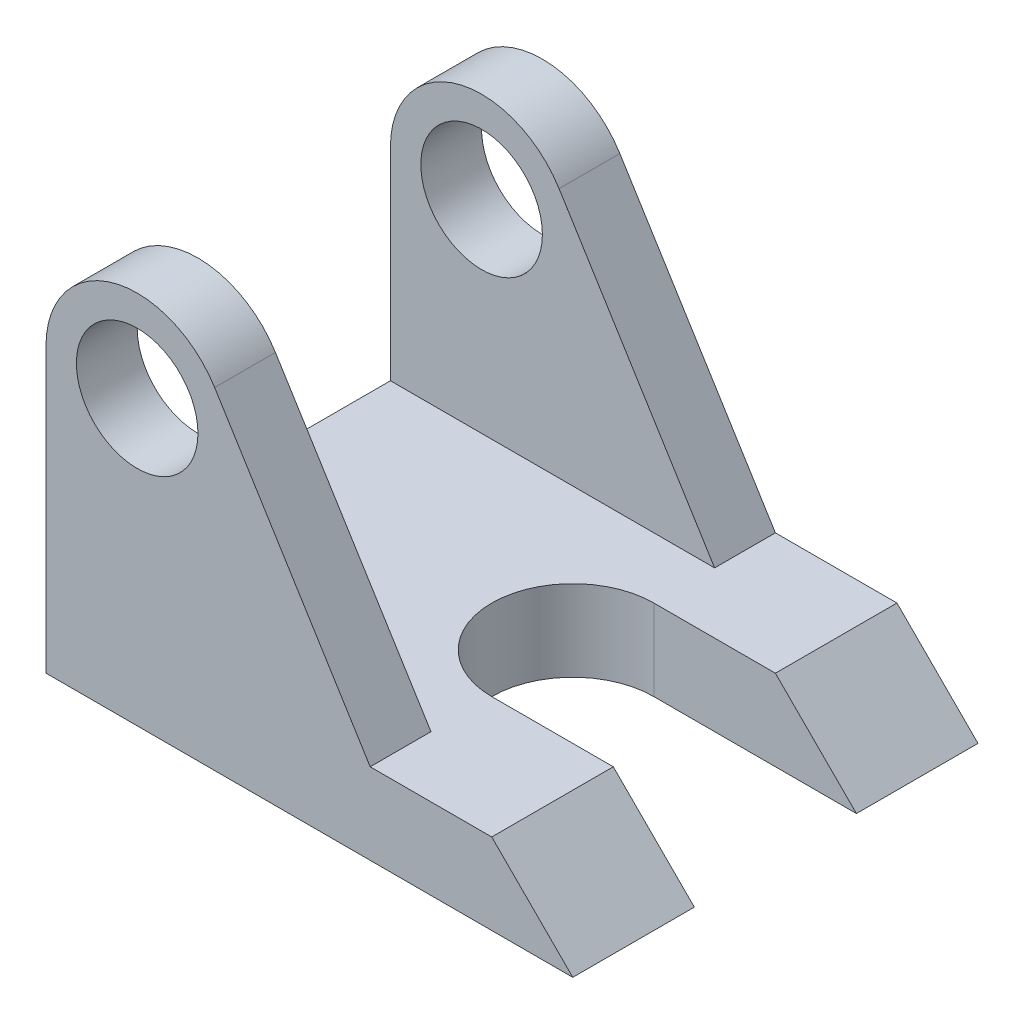
ISO-10303-21;
HEADER;
FILE_DESCRIPTION(('STEP AP214'),'2;1');
FILE_NAME('part.step','',(''),(''),'','','');
FILE_SCHEMA(('AUTOMOTIVE_DESIGN { 1 0 10303 214 1 1 1 1 }'));
ENDSEC;
DATA;
#1=APPLICATION_CONTEXT('core data for automotive mechanical design processes');
#2=APPLICATION_PROTOCOL_DEFINITION('international standard','automotive_design',2000,#1);
#3=PRODUCT_CONTEXT('',#1,'mechanical');
#4=PRODUCT('Part','Part','',(#3));
#5=PRODUCT_RELATED_PRODUCT_CATEGORY('part','',(#4));
#6=PRODUCT_DEFINITION_FORMATION('','',#4);
#7=PRODUCT_DEFINITION_CONTEXT('part definition',#1,'design');
#8=PRODUCT_DEFINITION('design','',#6,#7);
#9=PRODUCT_DEFINITION_SHAPE('','',#8);
#10=(LENGTH_UNIT() NAMED_UNIT(*) SI_UNIT(.MILLI.,.METRE.));
#11=(NAMED_UNIT(*) PLANE_ANGLE_UNIT() SI_UNIT($,.RADIAN.));
#12=(NAMED_UNIT(*) SI_UNIT($,.STERADIAN.) SOLID_ANGLE_UNIT());
#13=UNCERTAINTY_MEASURE_WITH_UNIT(LENGTH_MEASURE(1.E-05),#10,'distance_accuracy_value','');
#14=(GEOMETRIC_REPRESENTATION_CONTEXT(3) GLOBAL_UNCERTAINTY_ASSIGNED_CONTEXT((#13)) GLOBAL_UNIT_ASSIGNED_CONTEXT((#10,
#11,#12)) REPRESENTATION_CONTEXT('',''));
#15=CARTESIAN_POINT('',(0.,0.,0.));
#16=DIRECTION('',(0.,0.,1.));
#17=DIRECTION('',(1.,0.,0.));
#18=AXIS2_PLACEMENT_3D('',#15,#16,#17);
#19=CARTESIAN_POINT('',(65.,65.,-100.));
#20=DIRECTION('',(-0.707106781186547,-0.707106781186548,0.));
#21=DIRECTION('',(0.707106781186548,-0.707106781186547,0.));
#22=AXIS2_PLACEMENT_3D('',#19,#20,#21);
#23=PLANE('',#22);
#24=DIRECTION('',(0.,0.,1.));
#25=VECTOR('',#24,1.);
#26=CARTESIAN_POINT('',(110.,20.,-100.));
#27=LINE('',#26,#25);
#28=CARTESIAN_POINT('',(110.,20.,-100.));
#29=VERTEX_POINT('',#28);
#30=CARTESIAN_POINT('',(110.,20.,-70.));
#31=VERTEX_POINT('',#30);
#32=EDGE_CURVE('E188',#29,#31,#27,.T.);
#33=ORIENTED_EDGE('',*,*,#32,.T.);
#34=DIRECTION('',(0.707106781186548,-0.707106781186547,0.));
#35=VECTOR('',#34,1.);
#36=CARTESIAN_POINT('',(65.,65.,-70.));
#37=LINE('',#36,#35);
#38=CARTESIAN_POINT('',(130.,0.,-70.));
#39=VERTEX_POINT('',#38);
#40=EDGE_CURVE('E132',#31,#39,#37,.T.);
#41=ORIENTED_EDGE('',*,*,#40,.T.);
#42=DIRECTION('',(0.,0.,1.));
#43=VECTOR('',#42,1.);
#44=CARTESIAN_POINT('',(130.,0.,-100.));
#45=LINE('',#44,#43);
#46=CARTESIAN_POINT('',(130.,0.,-100.));
#47=VERTEX_POINT('',#46);
#48=EDGE_CURVE('E129',#47,#39,#45,.T.);
#49=ORIENTED_EDGE('',*,*,#48,.F.);
#50=DIRECTION('',(0.707106781186548,-0.707106781186547,0.));
#51=VECTOR('',#50,1.);
#52=CARTESIAN_POINT('',(65.,65.,-100.));
#53=LINE('',#52,#51);
#54=EDGE_CURVE('E116',#29,#47,#53,.T.);
#55=ORIENTED_EDGE('',*,*,#54,.F.);
#56=EDGE_LOOP('',(#33,#41,#49,#55));
#57=FACE_BOUND('',#56,.T.);
#58=ADVANCED_FACE('F43',(#57),#23,.F.);
#59=CARTESIAN_POINT('',(66.7243801501366,41.3975716511801,-100.));
#60=DIRECTION('',(-0.849740356450421,-0.527201409917985,0.));
#61=DIRECTION('',(0.527201409917985,-0.849740356450421,0.));
#62=AXIS2_PLACEMENT_3D('',#59,#60,#61);
#63=PLANE('',#62);
#64=DIRECTION('',(0.527201409917985,-0.849740356450421,0.));
#65=VECTOR('',#64,1.);
#66=CARTESIAN_POINT('',(66.7243801501366,41.3975716511801,-15.));
#67=LINE('',#66,#65);
#68=CARTESIAN_POINT('',(41.6191580201345,81.8620317231547,-15.));
#69=VERTEX_POINT('',#68);
#70=CARTESIAN_POINT('',(80.,20.,-15.));
#71=VERTEX_POINT('',#70);
#72=EDGE_CURVE('E163',#69,#71,#67,.T.);
#73=ORIENTED_EDGE('',*,*,#72,.F.);
#74=DIRECTION('',(0.,0.,1.));
#75=VECTOR('',#74,1.);
#76=CARTESIAN_POINT('',(41.6191580201345,81.8620317231546,-100.));
#77=LINE('',#76,#75);
#78=CARTESIAN_POINT('',(41.6191580201345,81.8620317231546,0.));
#79=VERTEX_POINT('',#78);
#80=EDGE_CURVE('E157',#69,#79,#77,.T.);
#81=ORIENTED_EDGE('',*,*,#80,.T.);
#82=DIRECTION('',(0.527201409917985,-0.849740356450421,0.));
#83=VECTOR('',#82,1.);
#84=CARTESIAN_POINT('',(66.7243801501366,41.3975716511801,0.));
#85=LINE('',#84,#83);
#86=CARTESIAN_POINT('',(80.,20.,0.));
#87=VERTEX_POINT('',#86);
#88=EDGE_CURVE('E158',#79,#87,#85,.T.);
#89=ORIENTED_EDGE('',*,*,#88,.T.);
#90=DIRECTION('',(0.,0.,1.));
#91=VECTOR('',#90,1.);
#92=CARTESIAN_POINT('',(80.,20.,-100.));
#93=LINE('',#92,#91);
#94=EDGE_CURVE('E95',#71,#87,#93,.T.);
#95=ORIENTED_EDGE('',*,*,#94,.F.);
#96=EDGE_LOOP('',(#73,#81,#89,#95));
#97=FACE_BOUND('',#96,.T.);
#98=ADVANCED_FACE('F45',(#97),#63,.F.);
#99=DIRECTION('',(-0.527201409917985,0.849740356450421,0.));
#100=VECTOR('',#99,1.);
#101=CARTESIAN_POINT('',(66.7243801501366,41.3975716511801,-85.));
#102=LINE('',#101,#100);
#103=CARTESIAN_POINT('',(80.,20.,-85.));
#104=VERTEX_POINT('',#103);
#105=CARTESIAN_POINT('',(41.6191580201345,81.8620317231547,-85.));
#106=VERTEX_POINT('',#105);
#107=EDGE_CURVE('E209',#104,#106,#102,.T.);
#108=ORIENTED_EDGE('',*,*,#107,.F.);
#109=CARTESIAN_POINT('',(80.,20.,-100.));
#110=VERTEX_POINT('',#109);
#111=EDGE_CURVE('E52',#110,#104,#93,.T.);
#112=ORIENTED_EDGE('',*,*,#111,.F.);
#113=DIRECTION('',(0.527201409917985,-0.849740356450421,0.));
#114=VECTOR('',#113,1.);
#115=CARTESIAN_POINT('',(66.7243801501366,41.3975716511801,-100.));
#116=LINE('',#115,#114);
#117=CARTESIAN_POINT('',(41.6191580201345,81.8620317231546,-100.));
#118=VERTEX_POINT('',#117);
#119=EDGE_CURVE('E185',#118,#110,#116,.T.);
#120=ORIENTED_EDGE('',*,*,#119,.F.);
#121=EDGE_CURVE('E104',#118,#106,#77,.T.);
#122=ORIENTED_EDGE('',*,*,#121,.T.);
#123=EDGE_LOOP('',(#108,#112,#120,#122));
#124=FACE_BOUND('',#123,.T.);
#125=ADVANCED_FACE('F318',(#124),#63,.F.);
#126=CARTESIAN_POINT('',(0.,0.,-100.));
#127=DIRECTION('',(1.,0.,0.));
#128=DIRECTION('',(0.,0.,-1.));
#129=AXIS2_PLACEMENT_3D('',#126,#127,#128);
#130=PLANE('',#129);
#131=DIRECTION('',(0.,1.,0.));
#132=VECTOR('',#131,1.);
#133=CARTESIAN_POINT('',(0.,0.,-15.));
#134=LINE('',#133,#132);
#135=CARTESIAN_POINT('',(0.,20.,-15.));
#136=VERTEX_POINT('',#135);
#137=CARTESIAN_POINT('',(0.,70.,-15.));
#138=VERTEX_POINT('',#137);
#139=EDGE_CURVE('E215',#136,#138,#134,.T.);
#140=ORIENTED_EDGE('',*,*,#139,.F.);
#141=DIRECTION('',(0.,0.,1.));
#142=VECTOR('',#141,1.);
#143=CARTESIAN_POINT('',(0.,20.,-100.));
#144=LINE('',#143,#142);
#145=CARTESIAN_POINT('',(0.,20.,-85.));
#146=VERTEX_POINT('',#145);
#147=EDGE_CURVE('E11',#146,#136,#144,.T.);
#148=ORIENTED_EDGE('',*,*,#147,.F.);
#149=DIRECTION('',(0.,-1.,0.));
#150=VECTOR('',#149,1.);
#151=CARTESIAN_POINT('',(0.,0.,-85.));
#152=LINE('',#151,#150);
#153=CARTESIAN_POINT('',(0.,70.,-85.));
#154=VERTEX_POINT('',#153);
#155=EDGE_CURVE('E218',#154,#146,#152,.T.);
#156=ORIENTED_EDGE('',*,*,#155,.F.);
#157=DIRECTION('',(0.,0.,1.));
#158=VECTOR('',#157,1.);
#159=CARTESIAN_POINT('',(0.,70.,-100.));
#160=LINE('',#159,#158);
#161=CARTESIAN_POINT('',(0.,70.,-100.));
#162=VERTEX_POINT('',#161);
#163=EDGE_CURVE('E193',#162,#154,#160,.T.);
#164=ORIENTED_EDGE('',*,*,#163,.F.);
#165=DIRECTION('',(0.,1.,0.));
#166=VECTOR('',#165,1.);
#167=CARTESIAN_POINT('',(0.,0.,-100.));
#168=LINE('',#167,#166);
#169=CARTESIAN_POINT('',(0.,0.,-100.));
#170=VERTEX_POINT('',#169);
#171=EDGE_CURVE('E144',#170,#162,#168,.T.);
#172=ORIENTED_EDGE('',*,*,#171,.F.);
#173=DIRECTION('',(0.,0.,1.));
#174=VECTOR('',#173,1.);
#175=CARTESIAN_POINT('',(0.,0.,-100.));
#176=LINE('',#175,#174);
#177=CARTESIAN_POINT('',(0.,0.,0.));
#178=VERTEX_POINT('',#177);
#179=EDGE_CURVE('E141',#170,#178,#176,.T.);
#180=ORIENTED_EDGE('',*,*,#179,.T.);
#181=DIRECTION('',(0.,1.,0.));
#182=VECTOR('',#181,1.);
#183=CARTESIAN_POINT('',(0.,0.,0.));
#184=LINE('',#183,#182);
#185=CARTESIAN_POINT('',(0.,70.,0.));
#186=VERTEX_POINT('',#185);
#187=EDGE_CURVE('E167',#178,#186,#184,.T.);
#188=ORIENTED_EDGE('',*,*,#187,.T.);
#189=EDGE_CURVE('E197',#138,#186,#160,.T.);
#190=ORIENTED_EDGE('',*,*,#189,.F.);
#191=EDGE_LOOP('',(#140,#148,#156,#164,#172,#180,#188,#190));
#192=FACE_BOUND('',#191,.T.);
#193=ADVANCED_FACE('F246',(#192),#130,.F.);
#194=CARTESIAN_POINT('',(22.5,70.,-100.));
#195=DIRECTION('',(0.,0.,1.));
#196=DIRECTION('',(1.,0.,0.));
#197=AXIS2_PLACEMENT_3D('',#194,#195,#196);
#198=CYLINDRICAL_SURFACE('',#197,22.5);
#199=CARTESIAN_POINT('',(22.5,70.,-15.));
#200=DIRECTION('',(0.,0.,-1.));
#201=DIRECTION('',(-1.,0.,0.));
#202=AXIS2_PLACEMENT_3D('',#199,#200,#201);
#203=CIRCLE('',#202,22.5);
#204=EDGE_CURVE('E208',#69,#138,#203,.F.);
#205=ORIENTED_EDGE('',*,*,#204,.T.);
#206=ORIENTED_EDGE('',*,*,#189,.T.);
#207=CARTESIAN_POINT('',(22.5,70.,0.));
#208=DIRECTION('',(0.,0.,1.));
#209=DIRECTION('',(1.,0.,0.));
#210=AXIS2_PLACEMENT_3D('',#207,#208,#209);
#211=CIRCLE('',#210,22.5);
#212=EDGE_CURVE('E162',#79,#186,#211,.T.);
#213=ORIENTED_EDGE('',*,*,#212,.F.);
#214=ORIENTED_EDGE('',*,*,#80,.F.);
#215=EDGE_LOOP('',(#205,#206,#213,#214));
#216=FACE_BOUND('',#215,.T.);
#217=ADVANCED_FACE('F275',(#216),#198,.T.);
#218=CARTESIAN_POINT('',(22.5,70.,-85.));
#219=DIRECTION('',(0.,0.,1.));
#220=DIRECTION('',(1.,0.,0.));
#221=AXIS2_PLACEMENT_3D('',#218,#219,#220);
#222=CIRCLE('',#221,22.5);
#223=EDGE_CURVE('E203',#154,#106,#222,.F.);
#224=ORIENTED_EDGE('',*,*,#223,.T.);
#225=ORIENTED_EDGE('',*,*,#121,.F.);
#226=CARTESIAN_POINT('',(22.5,70.,-100.));
#227=DIRECTION('',(0.,0.,1.));
#228=DIRECTION('',(1.,0.,0.));
#229=AXIS2_PLACEMENT_3D('',#226,#227,#228);
#230=CIRCLE('',#229,22.5);
#231=EDGE_CURVE('E147',#118,#162,#230,.T.);
#232=ORIENTED_EDGE('',*,*,#231,.T.);
#233=ORIENTED_EDGE('',*,*,#163,.T.);
#234=EDGE_LOOP('',(#224,#225,#232,#233));
#235=FACE_BOUND('',#234,.T.);
#236=ADVANCED_FACE('F239',(#235),#198,.T.);
#237=CARTESIAN_POINT('',(22.5,70.,-100.));
#238=DIRECTION('',(0.,0.,1.));
#239=DIRECTION('',(1.,0.,0.));
#240=AXIS2_PLACEMENT_3D('',#237,#238,#239);
#241=CYLINDRICAL_SURFACE('',#240,15.);
#242=CARTESIAN_POINT('',(22.5,70.,0.));
#243=DIRECTION('',(0.,0.,1.));
#244=DIRECTION('',(1.,0.,0.));
#245=AXIS2_PLACEMENT_3D('',#242,#243,#244);
#246=CIRCLE('',#245,15.);
#247=CARTESIAN_POINT('',(37.5,70.,0.));
#248=VERTEX_POINT('',#247);
#249=EDGE_CURVE('E181',#248,#248,#246,.T.);
#250=ORIENTED_EDGE('',*,*,#249,.T.);
#251=EDGE_LOOP('',(#250));
#252=FACE_BOUND('',#251,.T.);
#253=CARTESIAN_POINT('',(22.5,70.,-15.));
#254=DIRECTION('',(0.,0.,-1.));
#255=DIRECTION('',(-1.,0.,0.));
#256=AXIS2_PLACEMENT_3D('',#253,#254,#255);
#257=CIRCLE('',#256,15.);
#258=CARTESIAN_POINT('',(7.5,70.,-15.));
#259=VERTEX_POINT('',#258);
#260=EDGE_CURVE('E205',#259,#259,#257,.F.);
#261=ORIENTED_EDGE('',*,*,#260,.F.);
#262=EDGE_LOOP('',(#261));
#263=FACE_BOUND('',#262,.T.);
#264=ADVANCED_FACE('F393',(#252,#263),#241,.F.);
#265=CARTESIAN_POINT('',(22.5,70.,-100.));
#266=DIRECTION('',(0.,0.,1.));
#267=DIRECTION('',(1.,0.,0.));
#268=AXIS2_PLACEMENT_3D('',#265,#266,#267);
#269=CIRCLE('',#268,15.);
#270=CARTESIAN_POINT('',(37.5,70.,-100.));
#271=VERTEX_POINT('',#270);
#272=EDGE_CURVE('E153',#271,#271,#269,.T.);
#273=ORIENTED_EDGE('',*,*,#272,.F.);
#274=EDGE_LOOP('',(#273));
#275=FACE_BOUND('',#274,.T.);
#276=CARTESIAN_POINT('',(22.5,70.,-85.));
#277=DIRECTION('',(0.,0.,1.));
#278=DIRECTION('',(1.,0.,0.));
#279=AXIS2_PLACEMENT_3D('',#276,#277,#278);
#280=CIRCLE('',#279,15.);
#281=CARTESIAN_POINT('',(37.5,70.,-85.));
#282=VERTEX_POINT('',#281);
#283=EDGE_CURVE('E200',#282,#282,#280,.F.);
#284=ORIENTED_EDGE('',*,*,#283,.F.);
#285=EDGE_LOOP('',(#284));
#286=FACE_BOUND('',#285,.T.);
#287=ADVANCED_FACE('F312',(#275,#286),#241,.F.);
#288=CARTESIAN_POINT('',(0.,20.,-100.));
#289=DIRECTION('',(0.,-1.,0.));
#290=DIRECTION('',(1.,0.,0.));
#291=AXIS2_PLACEMENT_3D('',#288,#289,#290);
#292=PLANE('',#291);
#293=CARTESIAN_POINT('',(80.,20.,-50.));
#294=DIRECTION('',(0.,1.,0.));
#295=DIRECTION('',(-1.,0.,0.));
#296=AXIS2_PLACEMENT_3D('',#293,#294,#295);
#297=CIRCLE('',#296,20.);
#298=CARTESIAN_POINT('',(80.,20.,-70.));
#299=VERTEX_POINT('',#298);
#300=CARTESIAN_POINT('',(80.,20.,-30.));
#301=VERTEX_POINT('',#300);
#302=EDGE_CURVE('E348',#299,#301,#297,.T.);
#303=ORIENTED_EDGE('',*,*,#302,.F.);
#304=DIRECTION('',(-1.,0.,0.));
#305=VECTOR('',#304,1.);
#306=CARTESIAN_POINT('',(80.,20.,-70.));
#307=LINE('',#306,#305);
#308=EDGE_CURVE('E357',#31,#299,#307,.T.);
#309=ORIENTED_EDGE('',*,*,#308,.F.);
#310=ORIENTED_EDGE('',*,*,#32,.F.);
#311=DIRECTION('',(1.,0.,0.));
#312=VECTOR('',#311,1.);
#313=CARTESIAN_POINT('',(0.,20.,-100.));
#314=LINE('',#313,#312);
#315=EDGE_CURVE('E68',#110,#29,#314,.T.);
#316=ORIENTED_EDGE('',*,*,#315,.F.);
#317=ORIENTED_EDGE('',*,*,#111,.T.);
#318=DIRECTION('',(-1.,0.,0.));
#319=VECTOR('',#318,1.);
#320=CARTESIAN_POINT('',(-19.097686060403,20.,-85.));
#321=LINE('',#320,#319);
#322=EDGE_CURVE('E204',#104,#146,#321,.T.);
#323=ORIENTED_EDGE('',*,*,#322,.T.);
#324=ORIENTED_EDGE('',*,*,#147,.T.);
#325=DIRECTION('',(1.,0.,0.));
#326=VECTOR('',#325,1.);
#327=CARTESIAN_POINT('',(-19.097686060403,20.,-15.));
#328=LINE('',#327,#326);
#329=EDGE_CURVE('E259',#136,#71,#328,.T.);
#330=ORIENTED_EDGE('',*,*,#329,.T.);
#331=ORIENTED_EDGE('',*,*,#94,.T.);
#332=DIRECTION('',(1.,0.,0.));
#333=VECTOR('',#332,1.);
#334=CARTESIAN_POINT('',(0.,20.,0.));
#335=LINE('',#334,#333);
#336=CARTESIAN_POINT('',(110.,20.,0.));
#337=VERTEX_POINT('',#336);
#338=EDGE_CURVE('E178',#87,#337,#335,.T.);
#339=ORIENTED_EDGE('',*,*,#338,.T.);
#340=CARTESIAN_POINT('',(110.,20.,-30.));
#341=VERTEX_POINT('',#340);
#342=EDGE_CURVE('E136',#341,#337,#27,.T.);
#343=ORIENTED_EDGE('',*,*,#342,.F.);
#344=DIRECTION('',(1.,0.,0.));
#345=VECTOR('',#344,1.);
#346=CARTESIAN_POINT('',(130.,20.,-30.));
#347=LINE('',#346,#345);
#348=EDGE_CURVE('E293',#301,#341,#347,.T.);
#349=ORIENTED_EDGE('',*,*,#348,.F.);
#350=EDGE_LOOP('',(#303,#309,#310,#316,#317,#323,#324,#330,#331,#339,#343,#349));
#351=FACE_BOUND('',#350,.T.);
#352=ADVANCED_FACE('F255',(#351),#292,.F.);
#353=CARTESIAN_POINT('',(130.,0.,-30.));
#354=VERTEX_POINT('',#353);
#355=CARTESIAN_POINT('',(130.,0.,0.));
#356=VERTEX_POINT('',#355);
#357=EDGE_CURVE('E137',#354,#356,#45,.T.);
#358=ORIENTED_EDGE('',*,*,#357,.F.);
#359=DIRECTION('',(-0.707106781186548,0.707106781186547,0.));
#360=VECTOR('',#359,1.);
#361=CARTESIAN_POINT('',(65.,65.,-30.));
#362=LINE('',#361,#360);
#363=EDGE_CURVE('E59',#354,#341,#362,.T.);
#364=ORIENTED_EDGE('',*,*,#363,.T.);
#365=ORIENTED_EDGE('',*,*,#342,.T.);
#366=DIRECTION('',(0.707106781186548,-0.707106781186547,0.));
#367=VECTOR('',#366,1.);
#368=CARTESIAN_POINT('',(65.,65.,0.));
#369=LINE('',#368,#367);
#370=EDGE_CURVE('E174',#337,#356,#369,.T.);
#371=ORIENTED_EDGE('',*,*,#370,.T.);
#372=EDGE_LOOP('',(#358,#364,#365,#371));
#373=FACE_BOUND('',#372,.T.);
#374=ADVANCED_FACE('F304',(#373),#23,.F.);
#375=CARTESIAN_POINT('',(0.,0.,-100.));
#376=DIRECTION('',(0.,1.,0.));
#377=DIRECTION('',(-1.,0.,0.));
#378=AXIS2_PLACEMENT_3D('',#375,#376,#377);
#379=PLANE('',#378);
#380=ORIENTED_EDGE('',*,*,#48,.T.);
#381=DIRECTION('',(-1.,0.,0.));
#382=VECTOR('',#381,1.);
#383=CARTESIAN_POINT('',(80.,0.,-70.));
#384=LINE('',#383,#382);
#385=CARTESIAN_POINT('',(80.,0.,-70.));
#386=VERTEX_POINT('',#385);
#387=EDGE_CURVE('E351',#39,#386,#384,.T.);
#388=ORIENTED_EDGE('',*,*,#387,.T.);
#389=CARTESIAN_POINT('',(80.,0.,-50.));
#390=DIRECTION('',(0.,1.,0.));
#391=DIRECTION('',(-1.,0.,0.));
#392=AXIS2_PLACEMENT_3D('',#389,#390,#391);
#393=CIRCLE('',#392,20.);
#394=CARTESIAN_POINT('',(80.,0.,-30.));
#395=VERTEX_POINT('',#394);
#396=EDGE_CURVE('E347',#386,#395,#393,.T.);
#397=ORIENTED_EDGE('',*,*,#396,.T.);
#398=DIRECTION('',(1.,0.,0.));
#399=VECTOR('',#398,1.);
#400=CARTESIAN_POINT('',(130.,0.,-30.));
#401=LINE('',#400,#399);
#402=EDGE_CURVE('E303',#395,#354,#401,.T.);
#403=ORIENTED_EDGE('',*,*,#402,.T.);
#404=ORIENTED_EDGE('',*,*,#357,.T.);
#405=DIRECTION('',(-1.,0.,0.));
#406=VECTOR('',#405,1.);
#407=CARTESIAN_POINT('',(0.,0.,0.));
#408=LINE('',#407,#406);
#409=EDGE_CURVE('E171',#356,#178,#408,.T.);
#410=ORIENTED_EDGE('',*,*,#409,.T.);
#411=ORIENTED_EDGE('',*,*,#179,.F.);
#412=DIRECTION('',(-1.,0.,0.));
#413=VECTOR('',#412,1.);
#414=CARTESIAN_POINT('',(0.,0.,-100.));
#415=LINE('',#414,#413);
#416=EDGE_CURVE('E121',#47,#170,#415,.T.);
#417=ORIENTED_EDGE('',*,*,#416,.F.);
#418=EDGE_LOOP('',(#380,#388,#397,#403,#404,#410,#411,#417));
#419=FACE_BOUND('',#418,.T.);
#420=ADVANCED_FACE('F139',(#419),#379,.F.);
#421=CARTESIAN_POINT('',(0.,0.,-100.));
#422=DIRECTION('',(0.,0.,1.));
#423=DIRECTION('',(1.,0.,0.));
#424=AXIS2_PLACEMENT_3D('',#421,#422,#423);
#425=PLANE('',#424);
#426=ORIENTED_EDGE('',*,*,#119,.T.);
#427=ORIENTED_EDGE('',*,*,#315,.T.);
#428=ORIENTED_EDGE('',*,*,#54,.T.);
#429=ORIENTED_EDGE('',*,*,#416,.T.);
#430=ORIENTED_EDGE('',*,*,#171,.T.);
#431=ORIENTED_EDGE('',*,*,#231,.F.);
#432=EDGE_LOOP('',(#426,#427,#428,#429,#430,#431));
#433=FACE_BOUND('',#432,.T.);
#434=ORIENTED_EDGE('',*,*,#272,.T.);
#435=EDGE_LOOP('',(#434));
#436=FACE_BOUND('',#435,.T.);
#437=ADVANCED_FACE('F118',(#433,#436),#425,.F.);
#438=CARTESIAN_POINT('',(0.,0.,0.));
#439=DIRECTION('',(0.,0.,1.));
#440=DIRECTION('',(1.,0.,0.));
#441=AXIS2_PLACEMENT_3D('',#438,#439,#440);
#442=PLANE('',#441);
#443=ORIENTED_EDGE('',*,*,#88,.F.);
#444=ORIENTED_EDGE('',*,*,#212,.T.);
#445=ORIENTED_EDGE('',*,*,#187,.F.);
#446=ORIENTED_EDGE('',*,*,#409,.F.);
#447=ORIENTED_EDGE('',*,*,#370,.F.);
#448=ORIENTED_EDGE('',*,*,#338,.F.);
#449=EDGE_LOOP('',(#443,#444,#445,#446,#447,#448));
#450=FACE_BOUND('',#449,.T.);
#451=ORIENTED_EDGE('',*,*,#249,.F.);
#452=EDGE_LOOP('',(#451));
#453=FACE_BOUND('',#452,.T.);
#454=ADVANCED_FACE('F285',(#450,#453),#442,.T.);
#455=CARTESIAN_POINT('',(-19.097686060403,92.5,-15.));
#456=DIRECTION('',(0.,0.,-1.));
#457=DIRECTION('',(-1.,0.,0.));
#458=AXIS2_PLACEMENT_3D('',#455,#456,#457);
#459=PLANE('',#458);
#460=ORIENTED_EDGE('',*,*,#260,.T.);
#461=EDGE_LOOP('',(#460));
#462=FACE_BOUND('',#461,.T.);
#463=ORIENTED_EDGE('',*,*,#72,.T.);
#464=ORIENTED_EDGE('',*,*,#329,.F.);
#465=ORIENTED_EDGE('',*,*,#139,.T.);
#466=ORIENTED_EDGE('',*,*,#204,.F.);
#467=EDGE_LOOP('',(#463,#464,#465,#466));
#468=FACE_BOUND('',#467,.T.);
#469=ADVANCED_FACE('F278',(#462,#468),#459,.T.);
#470=CARTESIAN_POINT('',(-19.097686060403,92.5,-85.));
#471=DIRECTION('',(0.,0.,1.));
#472=DIRECTION('',(1.,0.,0.));
#473=AXIS2_PLACEMENT_3D('',#470,#471,#472);
#474=PLANE('',#473);
#475=ORIENTED_EDGE('',*,*,#283,.T.);
#476=EDGE_LOOP('',(#475));
#477=FACE_BOUND('',#476,.T.);
#478=ORIENTED_EDGE('',*,*,#107,.T.);
#479=ORIENTED_EDGE('',*,*,#223,.F.);
#480=ORIENTED_EDGE('',*,*,#155,.T.);
#481=ORIENTED_EDGE('',*,*,#322,.F.);
#482=EDGE_LOOP('',(#478,#479,#480,#481));
#483=FACE_BOUND('',#482,.T.);
#484=ADVANCED_FACE('F251',(#477,#483),#474,.T.);
#485=CARTESIAN_POINT('',(80.,0.,-70.));
#486=DIRECTION('',(0.,0.,-1.));
#487=DIRECTION('',(-1.,0.,0.));
#488=AXIS2_PLACEMENT_3D('',#485,#486,#487);
#489=PLANE('',#488);
#490=ORIENTED_EDGE('',*,*,#308,.T.);
#491=DIRECTION('',(0.,1.,0.));
#492=VECTOR('',#491,1.);
#493=CARTESIAN_POINT('',(80.,0.,-70.));
#494=LINE('',#493,#492);
#495=EDGE_CURVE('E350',#386,#299,#494,.T.);
#496=ORIENTED_EDGE('',*,*,#495,.F.);
#497=ORIENTED_EDGE('',*,*,#387,.F.);
#498=ORIENTED_EDGE('',*,*,#40,.F.);
#499=EDGE_LOOP('',(#490,#496,#497,#498));
#500=FACE_BOUND('',#499,.T.);
#501=ADVANCED_FACE('F374',(#500),#489,.F.);
#502=CARTESIAN_POINT('',(130.,0.,-30.));
#503=DIRECTION('',(0.,0.,1.));
#504=DIRECTION('',(1.,0.,0.));
#505=AXIS2_PLACEMENT_3D('',#502,#503,#504);
#506=PLANE('',#505);
#507=ORIENTED_EDGE('',*,*,#402,.F.);
#508=DIRECTION('',(0.,1.,0.));
#509=VECTOR('',#508,1.);
#510=CARTESIAN_POINT('',(80.,0.,-30.));
#511=LINE('',#510,#509);
#512=EDGE_CURVE('E344',#395,#301,#511,.T.);
#513=ORIENTED_EDGE('',*,*,#512,.T.);
#514=ORIENTED_EDGE('',*,*,#348,.T.);
#515=ORIENTED_EDGE('',*,*,#363,.F.);
#516=EDGE_LOOP('',(#507,#513,#514,#515));
#517=FACE_BOUND('',#516,.T.);
#518=ADVANCED_FACE('F353',(#517),#506,.F.);
#519=CARTESIAN_POINT('',(80.,0.,-50.));
#520=DIRECTION('',(0.,1.,0.));
#521=DIRECTION('',(-1.,0.,0.));
#522=AXIS2_PLACEMENT_3D('',#519,#520,#521);
#523=CYLINDRICAL_SURFACE('',#522,20.);
#524=ORIENTED_EDGE('',*,*,#302,.T.);
#525=ORIENTED_EDGE('',*,*,#512,.F.);
#526=ORIENTED_EDGE('',*,*,#396,.F.);
#527=ORIENTED_EDGE('',*,*,#495,.T.);
#528=EDGE_LOOP('',(#524,#525,#526,#527));
#529=FACE_BOUND('',#528,.T.);
#530=ADVANCED_FACE('F345',(#529),#523,.F.);
#531=CLOSED_SHELL('',(#58,#98,#125,#193,#217,#236,#264,#287,#352,#374,#420,#437,#454,#469,#484,
#501,#518,#530));
#532=MANIFOLD_SOLID_BREP('B2',#531);
#533=ADVANCED_BREP_SHAPE_REPRESENTATION('',(#18,#532),#14);
#534=SHAPE_DEFINITION_REPRESENTATION(#9,#533);
ENDSEC;
END-ISO-10303-21;
